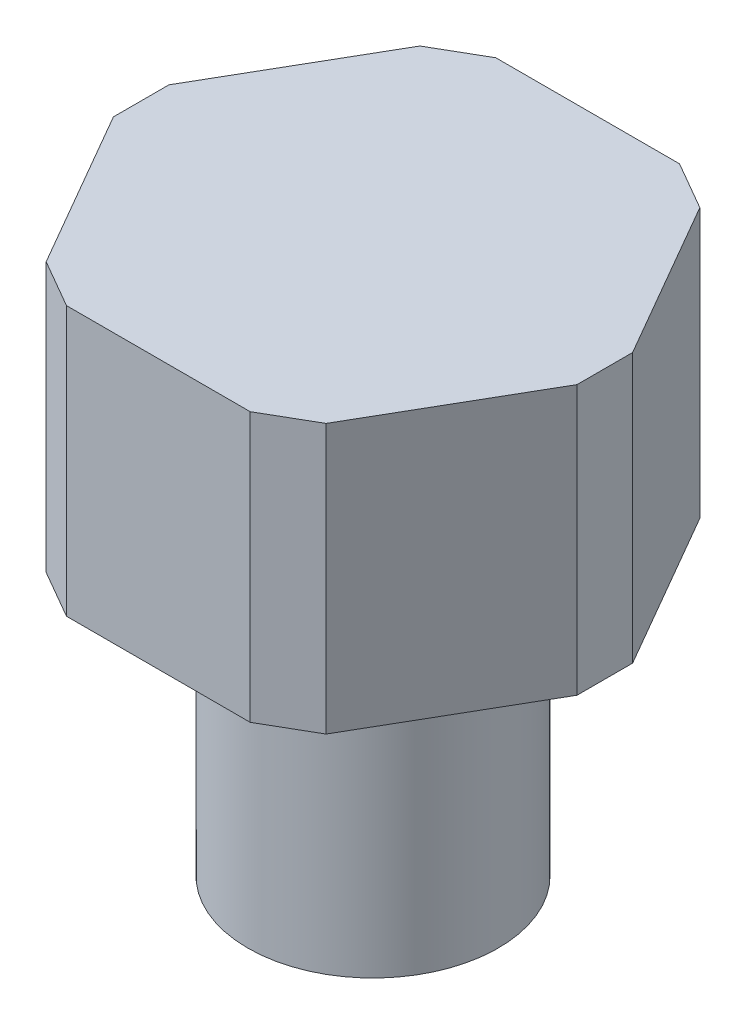
ISO-10303-21;
HEADER;
FILE_DESCRIPTION(('STEP AP214'),'2;1');
FILE_NAME('part.step','',(''),(''),'','','');
FILE_SCHEMA(('AUTOMOTIVE_DESIGN { 1 0 10303 214 1 1 1 1 }'));
ENDSEC;
DATA;
#1=APPLICATION_CONTEXT('core data for automotive mechanical design processes');
#2=APPLICATION_PROTOCOL_DEFINITION('international standard','automotive_design',2000,#1);
#3=PRODUCT_CONTEXT('',#1,'mechanical');
#4=PRODUCT('Part','Part','',(#3));
#5=PRODUCT_RELATED_PRODUCT_CATEGORY('part','',(#4));
#6=PRODUCT_DEFINITION_FORMATION('','',#4);
#7=PRODUCT_DEFINITION_CONTEXT('part definition',#1,'design');
#8=PRODUCT_DEFINITION('design','',#6,#7);
#9=PRODUCT_DEFINITION_SHAPE('','',#8);
#10=(LENGTH_UNIT() NAMED_UNIT(*) SI_UNIT(.MILLI.,.METRE.));
#11=(NAMED_UNIT(*) PLANE_ANGLE_UNIT() SI_UNIT($,.RADIAN.));
#12=(NAMED_UNIT(*) SI_UNIT($,.STERADIAN.) SOLID_ANGLE_UNIT());
#13=UNCERTAINTY_MEASURE_WITH_UNIT(LENGTH_MEASURE(1.E-05),#10,'distance_accuracy_value','');
#14=(GEOMETRIC_REPRESENTATION_CONTEXT(3) GLOBAL_UNCERTAINTY_ASSIGNED_CONTEXT((#13)) GLOBAL_UNIT_ASSIGNED_CONTEXT((#10,
#11,#12)) REPRESENTATION_CONTEXT('',''));
#15=CARTESIAN_POINT('',(0.,0.,0.));
#16=DIRECTION('',(0.,0.,1.));
#17=DIRECTION('',(1.,0.,0.));
#18=AXIS2_PLACEMENT_3D('',#15,#16,#17);
#19=CARTESIAN_POINT('',(0.,12.7,0.));
#20=DIRECTION('',(0.,-1.,0.));
#21=DIRECTION('',(0.,0.,-1.));
#22=AXIS2_PLACEMENT_3D('',#19,#20,#21);
#23=CYLINDRICAL_SURFACE('',#22,5.55625);
#24=CARTESIAN_POINT('',(0.,12.7,0.));
#25=DIRECTION('',(0.,1.,0.));
#26=DIRECTION('',(0.,0.,1.));
#27=AXIS2_PLACEMENT_3D('',#24,#25,#26);
#28=CIRCLE('',#27,5.55625);
#29=CARTESIAN_POINT('',(0.,12.7,5.55625));
#30=VERTEX_POINT('',#29);
#31=EDGE_CURVE('E11',#30,#30,#28,.T.);
#32=ORIENTED_EDGE('',*,*,#31,.F.);
#33=EDGE_LOOP('',(#32));
#34=FACE_BOUND('',#33,.T.);
#35=CARTESIAN_POINT('',(0.,0.,0.));
#36=DIRECTION('',(0.,1.,0.));
#37=DIRECTION('',(0.,0.,1.));
#38=AXIS2_PLACEMENT_3D('',#35,#36,#37);
#39=CIRCLE('',#38,5.55625);
#40=CARTESIAN_POINT('',(0.,0.,5.55625));
#41=VERTEX_POINT('',#40);
#42=EDGE_CURVE('E43',#41,#41,#39,.T.);
#43=ORIENTED_EDGE('',*,*,#42,.T.);
#44=EDGE_LOOP('',(#43));
#45=FACE_BOUND('',#44,.T.);
#46=ADVANCED_FACE('F40',(#34,#45),#23,.T.);
#47=CARTESIAN_POINT('',(0.,0.,0.));
#48=DIRECTION('',(0.,1.,0.));
#49=DIRECTION('',(0.,0.,1.));
#50=AXIS2_PLACEMENT_3D('',#47,#48,#49);
#51=PLANE('',#50);
#52=ORIENTED_EDGE('',*,*,#42,.F.);
#53=EDGE_LOOP('',(#52));
#54=FACE_BOUND('',#53,.T.);
#55=ADVANCED_FACE('F235',(#54),#51,.F.);
#56=CARTESIAN_POINT('',(0.,12.7,0.));
#57=DIRECTION('',(0.,-1.,0.));
#58=DIRECTION('',(0.,0.,-1.));
#59=AXIS2_PLACEMENT_3D('',#56,#57,#58);
#60=PLANE('',#59);
#61=DIRECTION('',(-0.5,0.,0.866025403784439));
#62=VECTOR('',#61,1.);
#63=CARTESIAN_POINT('',(-10.287,12.7,-1.23239334253896));
#64=LINE('',#63,#62);
#65=CARTESIAN_POINT('',(-6.21078389403118,12.7,-8.29260674070751));
#66=VERTEX_POINT('',#65);
#67=CARTESIAN_POINT('',(-10.287,12.7,-1.23239334253896));
#68=VERTEX_POINT('',#67);
#69=EDGE_CURVE('E173',#66,#68,#64,.T.);
#70=ORIENTED_EDGE('',*,*,#69,.F.);
#71=DIRECTION('',(-0.866025403784439,0.,0.5));
#72=VECTOR('',#71,1.);
#73=CARTESIAN_POINT('',(-6.21078389403118,12.7,-8.29260674070751));
#74=LINE('',#73,#72);
#75=CARTESIAN_POINT('',(-4.07621615403118,12.7,-9.525));
#76=VERTEX_POINT('',#75);
#77=EDGE_CURVE('E109',#76,#66,#74,.T.);
#78=ORIENTED_EDGE('',*,*,#77,.F.);
#79=DIRECTION('',(-1.,0.,0.));
#80=VECTOR('',#79,1.);
#81=CARTESIAN_POINT('',(-4.07621615403118,12.7,-9.525));
#82=LINE('',#81,#80);
#83=CARTESIAN_POINT('',(4.07621615403119,12.7,-9.525));
#84=VERTEX_POINT('',#83);
#85=EDGE_CURVE('E103',#84,#76,#82,.T.);
#86=ORIENTED_EDGE('',*,*,#85,.F.);
#87=DIRECTION('',(-0.866025403784439,0.,-0.5));
#88=VECTOR('',#87,1.);
#89=CARTESIAN_POINT('',(4.07621615403119,12.7,-9.525));
#90=LINE('',#89,#88);
#91=CARTESIAN_POINT('',(6.21078389403119,12.7,-8.29260674070751));
#92=VERTEX_POINT('',#91);
#93=EDGE_CURVE('E159',#92,#84,#90,.T.);
#94=ORIENTED_EDGE('',*,*,#93,.F.);
#95=DIRECTION('',(-0.5,0.,-0.866025403784439));
#96=VECTOR('',#95,1.);
#97=CARTESIAN_POINT('',(6.21078389403119,12.7,-8.29260674070751));
#98=LINE('',#97,#96);
#99=CARTESIAN_POINT('',(10.287,12.7,-1.23239334253896));
#100=VERTEX_POINT('',#99);
#101=EDGE_CURVE('E194',#100,#92,#98,.T.);
#102=ORIENTED_EDGE('',*,*,#101,.F.);
#103=DIRECTION('',(0.,0.,-1.));
#104=VECTOR('',#103,1.);
#105=CARTESIAN_POINT('',(10.287,12.7,-1.23239334253896));
#106=LINE('',#105,#104);
#107=CARTESIAN_POINT('',(10.287,12.7,1.23239334253896));
#108=VERTEX_POINT('',#107);
#109=EDGE_CURVE('E191',#108,#100,#106,.T.);
#110=ORIENTED_EDGE('',*,*,#109,.F.);
#111=DIRECTION('',(0.5,0.,-0.866025403784439));
#112=VECTOR('',#111,1.);
#113=CARTESIAN_POINT('',(10.287,12.7,1.23239334253896));
#114=LINE('',#113,#112);
#115=CARTESIAN_POINT('',(6.21078389403119,12.7,8.29260674070751));
#116=VERTEX_POINT('',#115);
#117=EDGE_CURVE('E188',#116,#108,#114,.T.);
#118=ORIENTED_EDGE('',*,*,#117,.F.);
#119=DIRECTION('',(0.866025403784439,0.,-0.5));
#120=VECTOR('',#119,1.);
#121=CARTESIAN_POINT('',(4.07621615403119,12.7,9.525));
#122=LINE('',#121,#120);
#123=CARTESIAN_POINT('',(4.07621615403119,12.7,9.525));
#124=VERTEX_POINT('',#123);
#125=EDGE_CURVE('E185',#124,#116,#122,.T.);
#126=ORIENTED_EDGE('',*,*,#125,.F.);
#127=DIRECTION('',(1.,0.,0.));
#128=VECTOR('',#127,1.);
#129=CARTESIAN_POINT('',(-4.07621615403119,12.7,9.525));
#130=LINE('',#129,#128);
#131=CARTESIAN_POINT('',(-4.07621615403119,12.7,9.525));
#132=VERTEX_POINT('',#131);
#133=EDGE_CURVE('E182',#132,#124,#130,.T.);
#134=ORIENTED_EDGE('',*,*,#133,.F.);
#135=DIRECTION('',(0.866025403784439,0.,0.5));
#136=VECTOR('',#135,1.);
#137=CARTESIAN_POINT('',(-6.21078389403119,12.7,8.29260674070751));
#138=LINE('',#137,#136);
#139=CARTESIAN_POINT('',(-6.21078389403119,12.7,8.29260674070751));
#140=VERTEX_POINT('',#139);
#141=EDGE_CURVE('E180',#140,#132,#138,.T.);
#142=ORIENTED_EDGE('',*,*,#141,.F.);
#143=DIRECTION('',(0.5,0.,0.866025403784439));
#144=VECTOR('',#143,1.);
#145=CARTESIAN_POINT('',(-10.287,12.7,1.23239334253896));
#146=LINE('',#145,#144);
#147=CARTESIAN_POINT('',(-10.287,12.7,1.23239334253896));
#148=VERTEX_POINT('',#147);
#149=EDGE_CURVE('E178',#148,#140,#146,.T.);
#150=ORIENTED_EDGE('',*,*,#149,.F.);
#151=DIRECTION('',(0.,0.,1.));
#152=VECTOR('',#151,1.);
#153=CARTESIAN_POINT('',(-10.287,12.7,-1.23239334253896));
#154=LINE('',#153,#152);
#155=EDGE_CURVE('E176',#68,#148,#154,.T.);
#156=ORIENTED_EDGE('',*,*,#155,.F.);
#157=EDGE_LOOP('',(#70,#78,#86,#94,#102,#110,#118,#126,#134,#142,#150,#156));
#158=FACE_BOUND('',#157,.T.);
#159=ORIENTED_EDGE('',*,*,#31,.T.);
#160=EDGE_LOOP('',(#159));
#161=FACE_BOUND('',#160,.T.);
#162=ADVANCED_FACE('F237',(#158,#161),#60,.T.);
#163=CARTESIAN_POINT('',(-10.287,24.638,-1.23239334253896));
#164=DIRECTION('',(0.866025403784439,0.,0.5));
#165=DIRECTION('',(0.5,0.,-0.866025403784439));
#166=AXIS2_PLACEMENT_3D('',#163,#164,#165);
#167=PLANE('',#166);
#168=ORIENTED_EDGE('',*,*,#69,.T.);
#169=DIRECTION('',(0.,-1.,0.));
#170=VECTOR('',#169,1.);
#171=CARTESIAN_POINT('',(-10.287,24.638,-1.23239334253896));
#172=LINE('',#171,#170);
#173=CARTESIAN_POINT('',(-10.287,24.638,-1.23239334253896));
#174=VERTEX_POINT('',#173);
#175=EDGE_CURVE('E228',#174,#68,#172,.T.);
#176=ORIENTED_EDGE('',*,*,#175,.F.);
#177=DIRECTION('',(-0.5,0.,0.866025403784439));
#178=VECTOR('',#177,1.);
#179=CARTESIAN_POINT('',(-10.287,24.638,-1.23239334253896));
#180=LINE('',#179,#178);
#181=CARTESIAN_POINT('',(-6.21078389403118,24.638,-8.29260674070751));
#182=VERTEX_POINT('',#181);
#183=EDGE_CURVE('E199',#182,#174,#180,.T.);
#184=ORIENTED_EDGE('',*,*,#183,.F.);
#185=DIRECTION('',(0.,-1.,0.));
#186=VECTOR('',#185,1.);
#187=CARTESIAN_POINT('',(-6.21078389403118,24.638,-8.29260674070751));
#188=LINE('',#187,#186);
#189=EDGE_CURVE('E169',#182,#66,#188,.T.);
#190=ORIENTED_EDGE('',*,*,#189,.T.);
#191=EDGE_LOOP('',(#168,#176,#184,#190));
#192=FACE_BOUND('',#191,.T.);
#193=ADVANCED_FACE('F242',(#192),#167,.F.);
#194=CARTESIAN_POINT('',(-10.287,24.638,-1.23239334253896));
#195=DIRECTION('',(1.,0.,0.));
#196=DIRECTION('',(0.,0.,-1.));
#197=AXIS2_PLACEMENT_3D('',#194,#195,#196);
#198=PLANE('',#197);
#199=ORIENTED_EDGE('',*,*,#155,.T.);
#200=DIRECTION('',(0.,-1.,0.));
#201=VECTOR('',#200,1.);
#202=CARTESIAN_POINT('',(-10.287,24.638,1.23239334253896));
#203=LINE('',#202,#201);
#204=CARTESIAN_POINT('',(-10.287,24.638,1.23239334253896));
#205=VERTEX_POINT('',#204);
#206=EDGE_CURVE('E225',#205,#148,#203,.T.);
#207=ORIENTED_EDGE('',*,*,#206,.F.);
#208=DIRECTION('',(0.,0.,1.));
#209=VECTOR('',#208,1.);
#210=CARTESIAN_POINT('',(-10.287,24.638,-1.23239334253896));
#211=LINE('',#210,#209);
#212=EDGE_CURVE('E118',#174,#205,#211,.T.);
#213=ORIENTED_EDGE('',*,*,#212,.F.);
#214=ORIENTED_EDGE('',*,*,#175,.T.);
#215=EDGE_LOOP('',(#199,#207,#213,#214));
#216=FACE_BOUND('',#215,.T.);
#217=ADVANCED_FACE('F249',(#216),#198,.F.);
#218=CARTESIAN_POINT('',(-10.287,24.638,1.23239334253896));
#219=DIRECTION('',(0.866025403784439,0.,-0.5));
#220=DIRECTION('',(-0.5,0.,-0.866025403784439));
#221=AXIS2_PLACEMENT_3D('',#218,#219,#220);
#222=PLANE('',#221);
#223=ORIENTED_EDGE('',*,*,#149,.T.);
#224=DIRECTION('',(0.,-1.,0.));
#225=VECTOR('',#224,1.);
#226=CARTESIAN_POINT('',(-6.21078389403119,24.638,8.29260674070751));
#227=LINE('',#226,#225);
#228=CARTESIAN_POINT('',(-6.21078389403119,24.638,8.29260674070751));
#229=VERTEX_POINT('',#228);
#230=EDGE_CURVE('E222',#229,#140,#227,.T.);
#231=ORIENTED_EDGE('',*,*,#230,.F.);
#232=DIRECTION('',(0.5,0.,0.866025403784439));
#233=VECTOR('',#232,1.);
#234=CARTESIAN_POINT('',(-10.287,24.638,1.23239334253896));
#235=LINE('',#234,#233);
#236=EDGE_CURVE('E394',#205,#229,#235,.T.);
#237=ORIENTED_EDGE('',*,*,#236,.F.);
#238=ORIENTED_EDGE('',*,*,#206,.T.);
#239=EDGE_LOOP('',(#223,#231,#237,#238));
#240=FACE_BOUND('',#239,.T.);
#241=ADVANCED_FACE('F253',(#240),#222,.F.);
#242=CARTESIAN_POINT('',(-6.21078389403119,24.638,8.29260674070751));
#243=DIRECTION('',(0.5,0.,-0.866025403784439));
#244=DIRECTION('',(-0.866025403784439,0.,-0.5));
#245=AXIS2_PLACEMENT_3D('',#242,#243,#244);
#246=PLANE('',#245);
#247=ORIENTED_EDGE('',*,*,#141,.T.);
#248=DIRECTION('',(0.,-1.,0.));
#249=VECTOR('',#248,1.);
#250=CARTESIAN_POINT('',(-4.07621615403119,24.638,9.525));
#251=LINE('',#250,#249);
#252=CARTESIAN_POINT('',(-4.07621615403119,24.638,9.525));
#253=VERTEX_POINT('',#252);
#254=EDGE_CURVE('E219',#253,#132,#251,.T.);
#255=ORIENTED_EDGE('',*,*,#254,.F.);
#256=DIRECTION('',(0.866025403784439,0.,0.5));
#257=VECTOR('',#256,1.);
#258=CARTESIAN_POINT('',(-6.21078389403119,24.638,8.29260674070751));
#259=LINE('',#258,#257);
#260=EDGE_CURVE('E398',#229,#253,#259,.T.);
#261=ORIENTED_EDGE('',*,*,#260,.F.);
#262=ORIENTED_EDGE('',*,*,#230,.T.);
#263=EDGE_LOOP('',(#247,#255,#261,#262));
#264=FACE_BOUND('',#263,.T.);
#265=ADVANCED_FACE('F256',(#264),#246,.F.);
#266=CARTESIAN_POINT('',(-4.07621615403119,24.638,9.525));
#267=DIRECTION('',(0.,0.,-1.));
#268=DIRECTION('',(-1.,0.,0.));
#269=AXIS2_PLACEMENT_3D('',#266,#267,#268);
#270=PLANE('',#269);
#271=ORIENTED_EDGE('',*,*,#133,.T.);
#272=DIRECTION('',(0.,-1.,0.));
#273=VECTOR('',#272,1.);
#274=CARTESIAN_POINT('',(4.07621615403119,24.638,9.525));
#275=LINE('',#274,#273);
#276=CARTESIAN_POINT('',(4.07621615403119,24.638,9.525));
#277=VERTEX_POINT('',#276);
#278=EDGE_CURVE('E215',#277,#124,#275,.T.);
#279=ORIENTED_EDGE('',*,*,#278,.F.);
#280=DIRECTION('',(1.,0.,0.));
#281=VECTOR('',#280,1.);
#282=CARTESIAN_POINT('',(-4.07621615403119,24.638,9.525));
#283=LINE('',#282,#281);
#284=EDGE_CURVE('E400',#253,#277,#283,.T.);
#285=ORIENTED_EDGE('',*,*,#284,.F.);
#286=ORIENTED_EDGE('',*,*,#254,.T.);
#287=EDGE_LOOP('',(#271,#279,#285,#286));
#288=FACE_BOUND('',#287,.T.);
#289=ADVANCED_FACE('F260',(#288),#270,.F.);
#290=CARTESIAN_POINT('',(4.07621615403119,24.638,9.525));
#291=DIRECTION('',(-0.5,0.,-0.866025403784439));
#292=DIRECTION('',(-0.866025403784439,0.,0.5));
#293=AXIS2_PLACEMENT_3D('',#290,#291,#292);
#294=PLANE('',#293);
#295=ORIENTED_EDGE('',*,*,#125,.T.);
#296=DIRECTION('',(0.,-1.,0.));
#297=VECTOR('',#296,1.);
#298=CARTESIAN_POINT('',(6.21078389403119,24.638,8.29260674070751));
#299=LINE('',#298,#297);
#300=CARTESIAN_POINT('',(6.21078389403119,24.638,8.29260674070751));
#301=VERTEX_POINT('',#300);
#302=EDGE_CURVE('E211',#301,#116,#299,.T.);
#303=ORIENTED_EDGE('',*,*,#302,.F.);
#304=DIRECTION('',(0.866025403784439,0.,-0.5));
#305=VECTOR('',#304,1.);
#306=CARTESIAN_POINT('',(4.07621615403119,24.638,9.525));
#307=LINE('',#306,#305);
#308=EDGE_CURVE('E402',#277,#301,#307,.T.);
#309=ORIENTED_EDGE('',*,*,#308,.F.);
#310=ORIENTED_EDGE('',*,*,#278,.T.);
#311=EDGE_LOOP('',(#295,#303,#309,#310));
#312=FACE_BOUND('',#311,.T.);
#313=ADVANCED_FACE('F264',(#312),#294,.F.);
#314=CARTESIAN_POINT('',(10.287,24.638,1.23239334253896));
#315=DIRECTION('',(-0.866025403784439,0.,-0.5));
#316=DIRECTION('',(-0.5,0.,0.866025403784439));
#317=AXIS2_PLACEMENT_3D('',#314,#315,#316);
#318=PLANE('',#317);
#319=ORIENTED_EDGE('',*,*,#117,.T.);
#320=DIRECTION('',(0.,-1.,0.));
#321=VECTOR('',#320,1.);
#322=CARTESIAN_POINT('',(10.287,24.638,1.23239334253896));
#323=LINE('',#322,#321);
#324=CARTESIAN_POINT('',(10.287,24.638,1.23239334253896));
#325=VERTEX_POINT('',#324);
#326=EDGE_CURVE('E207',#325,#108,#323,.T.);
#327=ORIENTED_EDGE('',*,*,#326,.F.);
#328=DIRECTION('',(0.5,0.,-0.866025403784439));
#329=VECTOR('',#328,1.);
#330=CARTESIAN_POINT('',(10.287,24.638,1.23239334253896));
#331=LINE('',#330,#329);
#332=EDGE_CURVE('E404',#301,#325,#331,.T.);
#333=ORIENTED_EDGE('',*,*,#332,.F.);
#334=ORIENTED_EDGE('',*,*,#302,.T.);
#335=EDGE_LOOP('',(#319,#327,#333,#334));
#336=FACE_BOUND('',#335,.T.);
#337=ADVANCED_FACE('F268',(#336),#318,.F.);
#338=CARTESIAN_POINT('',(10.287,24.638,-1.23239334253896));
#339=DIRECTION('',(-1.,0.,0.));
#340=DIRECTION('',(0.,0.,1.));
#341=AXIS2_PLACEMENT_3D('',#338,#339,#340);
#342=PLANE('',#341);
#343=ORIENTED_EDGE('',*,*,#109,.T.);
#344=DIRECTION('',(0.,-1.,0.));
#345=VECTOR('',#344,1.);
#346=CARTESIAN_POINT('',(10.287,24.638,-1.23239334253896));
#347=LINE('',#346,#345);
#348=CARTESIAN_POINT('',(10.287,24.638,-1.23239334253896));
#349=VERTEX_POINT('',#348);
#350=EDGE_CURVE('E204',#349,#100,#347,.T.);
#351=ORIENTED_EDGE('',*,*,#350,.F.);
#352=DIRECTION('',(0.,0.,-1.));
#353=VECTOR('',#352,1.);
#354=CARTESIAN_POINT('',(10.287,24.638,-1.23239334253896));
#355=LINE('',#354,#353);
#356=EDGE_CURVE('E406',#325,#349,#355,.T.);
#357=ORIENTED_EDGE('',*,*,#356,.F.);
#358=ORIENTED_EDGE('',*,*,#326,.T.);
#359=EDGE_LOOP('',(#343,#351,#357,#358));
#360=FACE_BOUND('',#359,.T.);
#361=ADVANCED_FACE('F272',(#360),#342,.F.);
#362=CARTESIAN_POINT('',(6.21078389403119,24.638,-8.29260674070751));
#363=DIRECTION('',(-0.866025403784439,0.,0.5));
#364=DIRECTION('',(0.5,0.,0.866025403784439));
#365=AXIS2_PLACEMENT_3D('',#362,#363,#364);
#366=PLANE('',#365);
#367=ORIENTED_EDGE('',*,*,#101,.T.);
#368=DIRECTION('',(0.,-1.,0.));
#369=VECTOR('',#368,1.);
#370=CARTESIAN_POINT('',(6.21078389403119,24.638,-8.29260674070751));
#371=LINE('',#370,#369);
#372=CARTESIAN_POINT('',(6.21078389403119,24.638,-8.29260674070751));
#373=VERTEX_POINT('',#372);
#374=EDGE_CURVE('E161',#373,#92,#371,.T.);
#375=ORIENTED_EDGE('',*,*,#374,.F.);
#376=DIRECTION('',(-0.5,0.,-0.866025403784439));
#377=VECTOR('',#376,1.);
#378=CARTESIAN_POINT('',(6.21078389403119,24.638,-8.29260674070751));
#379=LINE('',#378,#377);
#380=EDGE_CURVE('E150',#349,#373,#379,.T.);
#381=ORIENTED_EDGE('',*,*,#380,.F.);
#382=ORIENTED_EDGE('',*,*,#350,.T.);
#383=EDGE_LOOP('',(#367,#375,#381,#382));
#384=FACE_BOUND('',#383,.T.);
#385=ADVANCED_FACE('F276',(#384),#366,.F.);
#386=CARTESIAN_POINT('',(4.07621615403119,24.638,-9.525));
#387=DIRECTION('',(-0.5,0.,0.866025403784439));
#388=DIRECTION('',(0.866025403784439,0.,0.5));
#389=AXIS2_PLACEMENT_3D('',#386,#387,#388);
#390=PLANE('',#389);
#391=ORIENTED_EDGE('',*,*,#93,.T.);
#392=DIRECTION('',(0.,-1.,0.));
#393=VECTOR('',#392,1.);
#394=CARTESIAN_POINT('',(4.07621615403119,24.638,-9.525));
#395=LINE('',#394,#393);
#396=CARTESIAN_POINT('',(4.07621615403119,24.638,-9.525));
#397=VERTEX_POINT('',#396);
#398=EDGE_CURVE('E156',#397,#84,#395,.T.);
#399=ORIENTED_EDGE('',*,*,#398,.F.);
#400=DIRECTION('',(-0.866025403784439,0.,-0.5));
#401=VECTOR('',#400,1.);
#402=CARTESIAN_POINT('',(4.07621615403119,24.638,-9.525));
#403=LINE('',#402,#401);
#404=EDGE_CURVE('E144',#373,#397,#403,.T.);
#405=ORIENTED_EDGE('',*,*,#404,.F.);
#406=ORIENTED_EDGE('',*,*,#374,.T.);
#407=EDGE_LOOP('',(#391,#399,#405,#406));
#408=FACE_BOUND('',#407,.T.);
#409=ADVANCED_FACE('F157',(#408),#390,.F.);
#410=CARTESIAN_POINT('',(-4.07621615403118,24.638,-9.525));
#411=DIRECTION('',(0.,0.,1.));
#412=DIRECTION('',(1.,0.,0.));
#413=AXIS2_PLACEMENT_3D('',#410,#411,#412);
#414=PLANE('',#413);
#415=ORIENTED_EDGE('',*,*,#85,.T.);
#416=DIRECTION('',(0.,-1.,0.));
#417=VECTOR('',#416,1.);
#418=CARTESIAN_POINT('',(-4.07621615403118,24.638,-9.525));
#419=LINE('',#418,#417);
#420=CARTESIAN_POINT('',(-4.07621615403118,24.638,-9.525));
#421=VERTEX_POINT('',#420);
#422=EDGE_CURVE('E162',#421,#76,#419,.T.);
#423=ORIENTED_EDGE('',*,*,#422,.F.);
#424=DIRECTION('',(-1.,0.,0.));
#425=VECTOR('',#424,1.);
#426=CARTESIAN_POINT('',(-4.07621615403118,24.638,-9.525));
#427=LINE('',#426,#425);
#428=EDGE_CURVE('E148',#397,#421,#427,.T.);
#429=ORIENTED_EDGE('',*,*,#428,.F.);
#430=ORIENTED_EDGE('',*,*,#398,.T.);
#431=EDGE_LOOP('',(#415,#423,#429,#430));
#432=FACE_BOUND('',#431,.T.);
#433=ADVANCED_FACE('F164',(#432),#414,.F.);
#434=CARTESIAN_POINT('',(-6.21078389403118,24.638,-8.29260674070751));
#435=DIRECTION('',(0.5,0.,0.866025403784439));
#436=DIRECTION('',(0.866025403784439,0.,-0.5));
#437=AXIS2_PLACEMENT_3D('',#434,#435,#436);
#438=PLANE('',#437);
#439=ORIENTED_EDGE('',*,*,#77,.T.);
#440=ORIENTED_EDGE('',*,*,#189,.F.);
#441=DIRECTION('',(-0.866025403784439,0.,0.5));
#442=VECTOR('',#441,1.);
#443=CARTESIAN_POINT('',(-6.21078389403118,24.638,-8.29260674070751));
#444=LINE('',#443,#442);
#445=EDGE_CURVE('E60',#421,#182,#444,.T.);
#446=ORIENTED_EDGE('',*,*,#445,.F.);
#447=ORIENTED_EDGE('',*,*,#422,.T.);
#448=EDGE_LOOP('',(#439,#440,#446,#447));
#449=FACE_BOUND('',#448,.T.);
#450=ADVANCED_FACE('F285',(#449),#438,.F.);
#451=CARTESIAN_POINT('',(0.,24.638,0.));
#452=DIRECTION('',(0.,-1.,0.));
#453=DIRECTION('',(0.,0.,-1.));
#454=AXIS2_PLACEMENT_3D('',#451,#452,#453);
#455=PLANE('',#454);
#456=ORIENTED_EDGE('',*,*,#183,.T.);
#457=ORIENTED_EDGE('',*,*,#212,.T.);
#458=ORIENTED_EDGE('',*,*,#236,.T.);
#459=ORIENTED_EDGE('',*,*,#260,.T.);
#460=ORIENTED_EDGE('',*,*,#284,.T.);
#461=ORIENTED_EDGE('',*,*,#308,.T.);
#462=ORIENTED_EDGE('',*,*,#332,.T.);
#463=ORIENTED_EDGE('',*,*,#356,.T.);
#464=ORIENTED_EDGE('',*,*,#380,.T.);
#465=ORIENTED_EDGE('',*,*,#404,.T.);
#466=ORIENTED_EDGE('',*,*,#428,.T.);
#467=ORIENTED_EDGE('',*,*,#445,.T.);
#468=EDGE_LOOP('',(#456,#457,#458,#459,#460,#461,#462,#463,#464,#465,#466,#467));
#469=FACE_BOUND('',#468,.T.);
#470=ADVANCED_FACE('F146',(#469),#455,.F.);
#471=CLOSED_SHELL('',(#46,#55,#162,#193,#217,#241,#265,#289,#313,#337,#361,#385,#409,#433,#450,#470));
#472=MANIFOLD_SOLID_BREP('B2',#471);
#473=ADVANCED_BREP_SHAPE_REPRESENTATION('',(#18,#472),#14);
#474=SHAPE_DEFINITION_REPRESENTATION(#9,#473);
ENDSEC;
END-ISO-10303-21;
